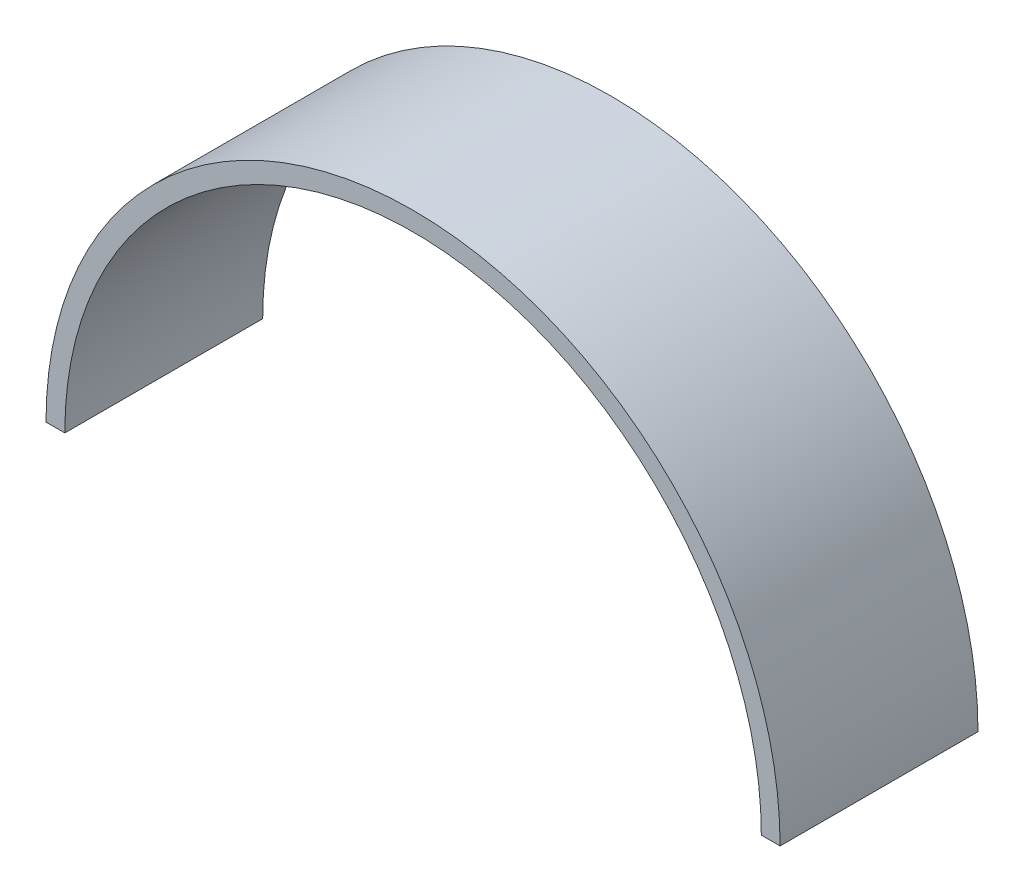
ISO-10303-21;
HEADER;
FILE_DESCRIPTION(('STEP AP214'),'2;1');
FILE_NAME('part.step','',(''),(''),'','','');
FILE_SCHEMA(('AUTOMOTIVE_DESIGN { 1 0 10303 214 1 1 1 1 }'));
ENDSEC;
DATA;
#1=APPLICATION_CONTEXT('core data for automotive mechanical design processes');
#2=APPLICATION_PROTOCOL_DEFINITION('international standard','automotive_design',2000,#1);
#3=PRODUCT_CONTEXT('',#1,'mechanical');
#4=PRODUCT('Part','Part','',(#3));
#5=PRODUCT_RELATED_PRODUCT_CATEGORY('part','',(#4));
#6=PRODUCT_DEFINITION_FORMATION('','',#4);
#7=PRODUCT_DEFINITION_CONTEXT('part definition',#1,'design');
#8=PRODUCT_DEFINITION('design','',#6,#7);
#9=PRODUCT_DEFINITION_SHAPE('','',#8);
#10=(LENGTH_UNIT() NAMED_UNIT(*) SI_UNIT(.MILLI.,.METRE.));
#11=(NAMED_UNIT(*) PLANE_ANGLE_UNIT() SI_UNIT($,.RADIAN.));
#12=(NAMED_UNIT(*) SI_UNIT($,.STERADIAN.) SOLID_ANGLE_UNIT());
#13=UNCERTAINTY_MEASURE_WITH_UNIT(LENGTH_MEASURE(1.E-05),#10,'distance_accuracy_value','');
#14=(GEOMETRIC_REPRESENTATION_CONTEXT(3) GLOBAL_UNCERTAINTY_ASSIGNED_CONTEXT((#13)) GLOBAL_UNIT_ASSIGNED_CONTEXT((#10,
#11,#12)) REPRESENTATION_CONTEXT('',''));
#15=CARTESIAN_POINT('',(0.,0.,0.));
#16=DIRECTION('',(0.,0.,1.));
#17=DIRECTION('',(1.,0.,0.));
#18=AXIS2_PLACEMENT_3D('',#15,#16,#17);
#19=CARTESIAN_POINT('',(0.,0.,25.4));
#20=DIRECTION('',(0.,0.,-1.));
#21=DIRECTION('',(-1.,0.,0.));
#22=AXIS2_PLACEMENT_3D('',#19,#20,#21);
#23=CYLINDRICAL_SURFACE('',#22,47.117);
#24=CARTESIAN_POINT('',(0.,0.,0.));
#25=DIRECTION('',(0.,0.,1.));
#26=DIRECTION('',(1.,0.,0.));
#27=AXIS2_PLACEMENT_3D('',#24,#25,#26);
#28=CIRCLE('',#27,47.117);
#29=CARTESIAN_POINT('',(47.117,0.,0.));
#30=VERTEX_POINT('',#29);
#31=CARTESIAN_POINT('',(-47.117,0.,0.));
#32=VERTEX_POINT('',#31);
#33=EDGE_CURVE('E104',#30,#32,#28,.T.);
#34=ORIENTED_EDGE('',*,*,#33,.T.);
#35=DIRECTION('',(0.,0.,-1.));
#36=VECTOR('',#35,1.);
#37=CARTESIAN_POINT('',(-47.117,0.,25.4));
#38=LINE('',#37,#36);
#39=CARTESIAN_POINT('',(-47.117,0.,25.4));
#40=VERTEX_POINT('',#39);
#41=EDGE_CURVE('E11',#40,#32,#38,.T.);
#42=ORIENTED_EDGE('',*,*,#41,.F.);
#43=CARTESIAN_POINT('',(0.,0.,25.4));
#44=DIRECTION('',(0.,0.,1.));
#45=DIRECTION('',(1.,0.,0.));
#46=AXIS2_PLACEMENT_3D('',#43,#44,#45);
#47=CIRCLE('',#46,47.117);
#48=CARTESIAN_POINT('',(47.117,0.,25.4));
#49=VERTEX_POINT('',#48);
#50=EDGE_CURVE('E92',#49,#40,#47,.T.);
#51=ORIENTED_EDGE('',*,*,#50,.F.);
#52=DIRECTION('',(0.,0.,-1.));
#53=VECTOR('',#52,1.);
#54=CARTESIAN_POINT('',(47.117,0.,25.4));
#55=LINE('',#54,#53);
#56=EDGE_CURVE('E100',#49,#30,#55,.T.);
#57=ORIENTED_EDGE('',*,*,#56,.T.);
#58=EDGE_LOOP('',(#34,#42,#51,#57));
#59=FACE_BOUND('',#58,.T.);
#60=ADVANCED_FACE('F41',(#59),#23,.T.);
#61=CARTESIAN_POINT('',(-47.117,0.,25.4));
#62=DIRECTION('',(0.,1.,0.));
#63=DIRECTION('',(0.,0.,1.));
#64=AXIS2_PLACEMENT_3D('',#61,#62,#63);
#65=PLANE('',#64);
#66=DIRECTION('',(1.,0.,0.));
#67=VECTOR('',#66,1.);
#68=CARTESIAN_POINT('',(-47.117,0.,0.));
#69=LINE('',#68,#67);
#70=CARTESIAN_POINT('',(-44.704,0.,0.));
#71=VERTEX_POINT('',#70);
#72=EDGE_CURVE('E96',#32,#71,#69,.T.);
#73=ORIENTED_EDGE('',*,*,#72,.T.);
#74=DIRECTION('',(0.,0.,-1.));
#75=VECTOR('',#74,1.);
#76=CARTESIAN_POINT('',(-44.704,0.,25.4));
#77=LINE('',#76,#75);
#78=CARTESIAN_POINT('',(-44.704,0.,25.4));
#79=VERTEX_POINT('',#78);
#80=EDGE_CURVE('E49',#79,#71,#77,.T.);
#81=ORIENTED_EDGE('',*,*,#80,.F.);
#82=DIRECTION('',(1.,0.,0.));
#83=VECTOR('',#82,1.);
#84=CARTESIAN_POINT('',(-47.117,0.,25.4));
#85=LINE('',#84,#83);
#86=EDGE_CURVE('E87',#40,#79,#85,.T.);
#87=ORIENTED_EDGE('',*,*,#86,.F.);
#88=ORIENTED_EDGE('',*,*,#41,.T.);
#89=EDGE_LOOP('',(#73,#81,#87,#88));
#90=FACE_BOUND('',#89,.T.);
#91=ADVANCED_FACE('F95',(#90),#65,.F.);
#92=CARTESIAN_POINT('',(0.,0.,25.4));
#93=DIRECTION('',(0.,0.,-1.));
#94=DIRECTION('',(-1.,0.,0.));
#95=AXIS2_PLACEMENT_3D('',#92,#93,#94);
#96=CYLINDRICAL_SURFACE('',#95,44.704);
#97=CARTESIAN_POINT('',(0.,0.,0.));
#98=DIRECTION('',(0.,0.,-1.));
#99=DIRECTION('',(1.,0.,0.));
#100=AXIS2_PLACEMENT_3D('',#97,#98,#99);
#101=CIRCLE('',#100,44.704);
#102=CARTESIAN_POINT('',(44.704,0.,0.));
#103=VERTEX_POINT('',#102);
#104=EDGE_CURVE('E74',#71,#103,#101,.T.);
#105=ORIENTED_EDGE('',*,*,#104,.T.);
#106=DIRECTION('',(0.,0.,-1.));
#107=VECTOR('',#106,1.);
#108=CARTESIAN_POINT('',(44.704,0.,25.4));
#109=LINE('',#108,#107);
#110=CARTESIAN_POINT('',(44.704,0.,25.4));
#111=VERTEX_POINT('',#110);
#112=EDGE_CURVE('E97',#111,#103,#109,.T.);
#113=ORIENTED_EDGE('',*,*,#112,.F.);
#114=CARTESIAN_POINT('',(0.,0.,25.4));
#115=DIRECTION('',(0.,0.,-1.));
#116=DIRECTION('',(1.,0.,0.));
#117=AXIS2_PLACEMENT_3D('',#114,#115,#116);
#118=CIRCLE('',#117,44.704);
#119=EDGE_CURVE('E90',#79,#111,#118,.T.);
#120=ORIENTED_EDGE('',*,*,#119,.F.);
#121=ORIENTED_EDGE('',*,*,#80,.T.);
#122=EDGE_LOOP('',(#105,#113,#120,#121));
#123=FACE_BOUND('',#122,.T.);
#124=ADVANCED_FACE('F98',(#123),#96,.F.);
#125=CARTESIAN_POINT('',(44.704,0.,25.4));
#126=DIRECTION('',(0.,1.,0.));
#127=DIRECTION('',(0.,0.,1.));
#128=AXIS2_PLACEMENT_3D('',#125,#126,#127);
#129=PLANE('',#128);
#130=DIRECTION('',(1.,0.,0.));
#131=VECTOR('',#130,1.);
#132=CARTESIAN_POINT('',(44.704,0.,0.));
#133=LINE('',#132,#131);
#134=EDGE_CURVE('E80',#103,#30,#133,.T.);
#135=ORIENTED_EDGE('',*,*,#134,.T.);
#136=ORIENTED_EDGE('',*,*,#56,.F.);
#137=DIRECTION('',(1.,0.,0.));
#138=VECTOR('',#137,1.);
#139=CARTESIAN_POINT('',(44.704,0.,25.4));
#140=LINE('',#139,#138);
#141=EDGE_CURVE('E57',#111,#49,#140,.T.);
#142=ORIENTED_EDGE('',*,*,#141,.F.);
#143=ORIENTED_EDGE('',*,*,#112,.T.);
#144=EDGE_LOOP('',(#135,#136,#142,#143));
#145=FACE_BOUND('',#144,.T.);
#146=ADVANCED_FACE('F111',(#145),#129,.F.);
#147=CARTESIAN_POINT('',(0.,0.,25.4));
#148=DIRECTION('',(0.,0.,1.));
#149=DIRECTION('',(1.,0.,0.));
#150=AXIS2_PLACEMENT_3D('',#147,#148,#149);
#151=PLANE('',#150);
#152=ORIENTED_EDGE('',*,*,#50,.T.);
#153=ORIENTED_EDGE('',*,*,#86,.T.);
#154=ORIENTED_EDGE('',*,*,#119,.T.);
#155=ORIENTED_EDGE('',*,*,#141,.T.);
#156=EDGE_LOOP('',(#152,#153,#154,#155));
#157=FACE_BOUND('',#156,.T.);
#158=ADVANCED_FACE('F88',(#157),#151,.T.);
#159=CARTESIAN_POINT('',(0.,0.,0.));
#160=DIRECTION('',(0.,0.,1.));
#161=DIRECTION('',(1.,0.,0.));
#162=AXIS2_PLACEMENT_3D('',#159,#160,#161);
#163=PLANE('',#162);
#164=ORIENTED_EDGE('',*,*,#33,.F.);
#165=ORIENTED_EDGE('',*,*,#134,.F.);
#166=ORIENTED_EDGE('',*,*,#104,.F.);
#167=ORIENTED_EDGE('',*,*,#72,.F.);
#168=EDGE_LOOP('',(#164,#165,#166,#167));
#169=FACE_BOUND('',#168,.T.);
#170=ADVANCED_FACE('F114',(#169),#163,.F.);
#171=CLOSED_SHELL('',(#60,#91,#124,#146,#158,#170));
#172=MANIFOLD_SOLID_BREP('B2',#171);
#173=ADVANCED_BREP_SHAPE_REPRESENTATION('',(#18,#172),#14);
#174=SHAPE_DEFINITION_REPRESENTATION(#9,#173);
ENDSEC;
END-ISO-10303-21;
